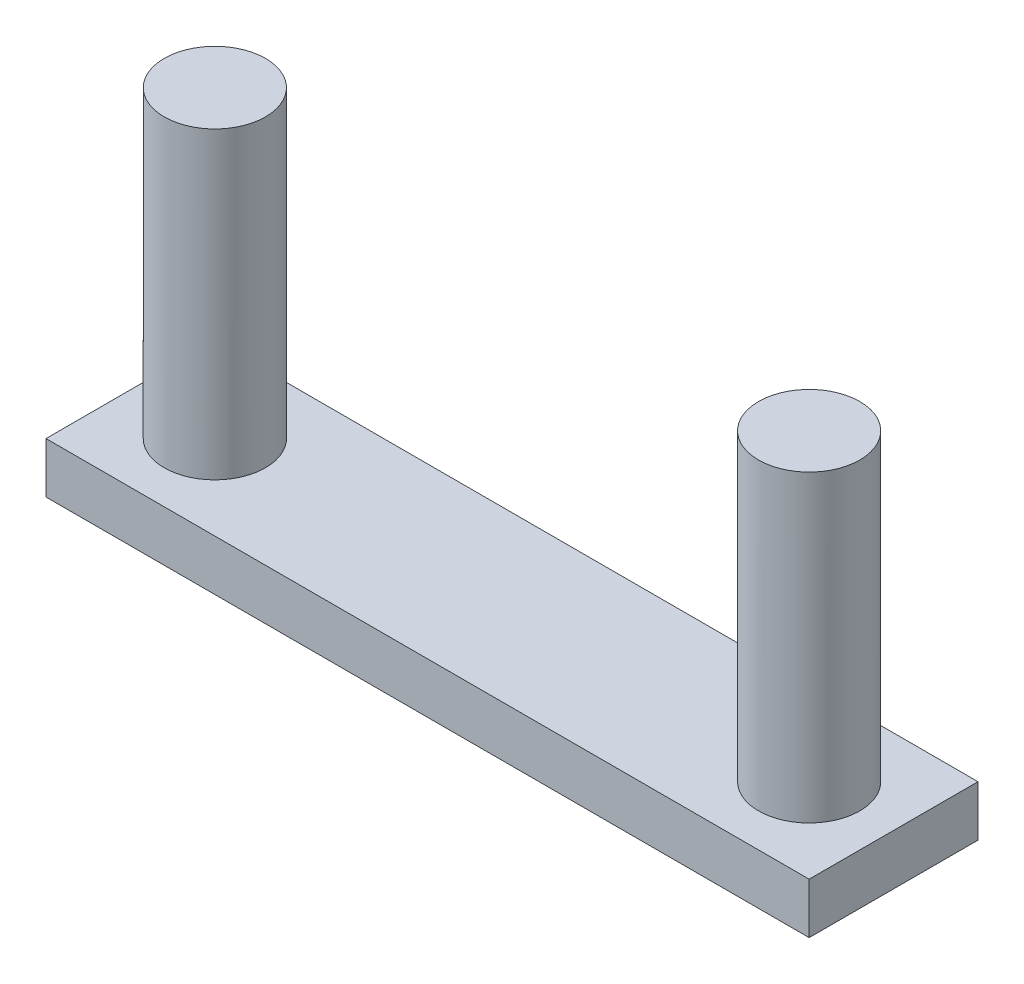
ISO-10303-21;
HEADER;
FILE_DESCRIPTION(('STEP AP214'),'2;1');
FILE_NAME('part.step','',(''),(''),'','','');
FILE_SCHEMA(('AUTOMOTIVE_DESIGN { 1 0 10303 214 1 1 1 1 }'));
ENDSEC;
DATA;
#1=APPLICATION_CONTEXT('core data for automotive mechanical design processes');
#2=APPLICATION_PROTOCOL_DEFINITION('international standard','automotive_design',2000,#1);
#3=PRODUCT_CONTEXT('',#1,'mechanical');
#4=PRODUCT('Part','Part','',(#3));
#5=PRODUCT_RELATED_PRODUCT_CATEGORY('part','',(#4));
#6=PRODUCT_DEFINITION_FORMATION('','',#4);
#7=PRODUCT_DEFINITION_CONTEXT('part definition',#1,'design');
#8=PRODUCT_DEFINITION('design','',#6,#7);
#9=PRODUCT_DEFINITION_SHAPE('','',#8);
#10=(LENGTH_UNIT() NAMED_UNIT(*) SI_UNIT(.MILLI.,.METRE.));
#11=(NAMED_UNIT(*) PLANE_ANGLE_UNIT() SI_UNIT($,.RADIAN.));
#12=(NAMED_UNIT(*) SI_UNIT($,.STERADIAN.) SOLID_ANGLE_UNIT());
#13=UNCERTAINTY_MEASURE_WITH_UNIT(LENGTH_MEASURE(1.E-05),#10,'distance_accuracy_value','');
#14=(GEOMETRIC_REPRESENTATION_CONTEXT(3) GLOBAL_UNCERTAINTY_ASSIGNED_CONTEXT((#13)) GLOBAL_UNIT_ASSIGNED_CONTEXT((#10,
#11,#12)) REPRESENTATION_CONTEXT('',''));
#15=CARTESIAN_POINT('',(0.,0.,0.));
#16=DIRECTION('',(0.,0.,1.));
#17=DIRECTION('',(1.,0.,0.));
#18=AXIS2_PLACEMENT_3D('',#15,#16,#17);
#19=CARTESIAN_POINT('',(-78.4865140429364,1.5,37.3441703001715));
#20=DIRECTION('',(1.,0.,0.));
#21=DIRECTION('',(0.,0.,-1.));
#22=AXIS2_PLACEMENT_3D('',#19,#20,#21);
#23=PLANE('',#22);
#24=DIRECTION('',(0.,0.,1.));
#25=VECTOR('',#24,1.);
#26=CARTESIAN_POINT('',(-78.4865140429364,0.,37.3441703001715));
#27=LINE('',#26,#25);
#28=CARTESIAN_POINT('',(-78.4865140429364,0.,32.3441703001715));
#29=VERTEX_POINT('',#28);
#30=CARTESIAN_POINT('',(-78.4865140429364,0.,37.3441703001715));
#31=VERTEX_POINT('',#30);
#32=EDGE_CURVE('E100',#29,#31,#27,.T.);
#33=ORIENTED_EDGE('',*,*,#32,.T.);
#34=DIRECTION('',(0.,-1.,0.));
#35=VECTOR('',#34,1.);
#36=CARTESIAN_POINT('',(-78.4865140429364,1.5,37.3441703001715));
#37=LINE('',#36,#35);
#38=CARTESIAN_POINT('',(-78.4865140429364,1.5,37.3441703001715));
#39=VERTEX_POINT('',#38);
#40=EDGE_CURVE('E91',#39,#31,#37,.T.);
#41=ORIENTED_EDGE('',*,*,#40,.F.);
#42=DIRECTION('',(0.,0.,1.));
#43=VECTOR('',#42,1.);
#44=CARTESIAN_POINT('',(-78.4865140429364,1.5,37.3441703001715));
#45=LINE('',#44,#43);
#46=CARTESIAN_POINT('',(-78.4865140429364,1.5,32.3441703001715));
#47=VERTEX_POINT('',#46);
#48=EDGE_CURVE('E85',#47,#39,#45,.T.);
#49=ORIENTED_EDGE('',*,*,#48,.F.);
#50=DIRECTION('',(0.,-1.,0.));
#51=VECTOR('',#50,1.);
#52=CARTESIAN_POINT('',(-78.4865140429364,1.5,32.3441703001715));
#53=LINE('',#52,#51);
#54=EDGE_CURVE('E96',#47,#29,#53,.T.);
#55=ORIENTED_EDGE('',*,*,#54,.T.);
#56=EDGE_LOOP('',(#33,#41,#49,#55));
#57=FACE_BOUND('',#56,.T.);
#58=ADVANCED_FACE('F33',(#57),#23,.F.);
#59=CARTESIAN_POINT('',(-78.4865140429364,1.5,37.3441703001715));
#60=DIRECTION('',(0.,0.,-1.));
#61=DIRECTION('',(-1.,0.,0.));
#62=AXIS2_PLACEMENT_3D('',#59,#60,#61);
#63=PLANE('',#62);
#64=DIRECTION('',(1.,0.,0.));
#65=VECTOR('',#64,1.);
#66=CARTESIAN_POINT('',(-78.4865140429364,0.,37.3441703001715));
#67=LINE('',#66,#65);
#68=CARTESIAN_POINT('',(-55.8865140429365,0.,37.3441703001715));
#69=VERTEX_POINT('',#68);
#70=EDGE_CURVE('E90',#31,#69,#67,.T.);
#71=ORIENTED_EDGE('',*,*,#70,.T.);
#72=DIRECTION('',(0.,-1.,0.));
#73=VECTOR('',#72,1.);
#74=CARTESIAN_POINT('',(-55.8865140429365,1.5,37.3441703001715));
#75=LINE('',#74,#73);
#76=CARTESIAN_POINT('',(-55.8865140429365,1.5,37.3441703001715));
#77=VERTEX_POINT('',#76);
#78=EDGE_CURVE('E88',#77,#69,#75,.T.);
#79=ORIENTED_EDGE('',*,*,#78,.F.);
#80=DIRECTION('',(1.,0.,0.));
#81=VECTOR('',#80,1.);
#82=CARTESIAN_POINT('',(-78.4865140429364,1.5,37.3441703001715));
#83=LINE('',#82,#81);
#84=EDGE_CURVE('E80',#39,#77,#83,.T.);
#85=ORIENTED_EDGE('',*,*,#84,.F.);
#86=ORIENTED_EDGE('',*,*,#40,.T.);
#87=EDGE_LOOP('',(#71,#79,#85,#86));
#88=FACE_BOUND('',#87,.T.);
#89=ADVANCED_FACE('F89',(#88),#63,.F.);
#90=CARTESIAN_POINT('',(-55.8865140429365,1.5,37.3441703001715));
#91=DIRECTION('',(-1.,0.,0.));
#92=DIRECTION('',(0.,0.,1.));
#93=AXIS2_PLACEMENT_3D('',#90,#91,#92);
#94=PLANE('',#93);
#95=DIRECTION('',(0.,0.,-1.));
#96=VECTOR('',#95,1.);
#97=CARTESIAN_POINT('',(-55.8865140429365,0.,37.3441703001715));
#98=LINE('',#97,#96);
#99=CARTESIAN_POINT('',(-55.8865140429365,0.,32.3441703001715));
#100=VERTEX_POINT('',#99);
#101=EDGE_CURVE('E66',#69,#100,#98,.T.);
#102=ORIENTED_EDGE('',*,*,#101,.T.);
#103=DIRECTION('',(0.,-1.,0.));
#104=VECTOR('',#103,1.);
#105=CARTESIAN_POINT('',(-55.8865140429365,1.5,32.3441703001715));
#106=LINE('',#105,#104);
#107=CARTESIAN_POINT('',(-55.8865140429365,1.5,32.3441703001715));
#108=VERTEX_POINT('',#107);
#109=EDGE_CURVE('E92',#108,#100,#106,.T.);
#110=ORIENTED_EDGE('',*,*,#109,.F.);
#111=DIRECTION('',(0.,0.,-1.));
#112=VECTOR('',#111,1.);
#113=CARTESIAN_POINT('',(-55.8865140429365,1.5,37.3441703001715));
#114=LINE('',#113,#112);
#115=EDGE_CURVE('E83',#77,#108,#114,.T.);
#116=ORIENTED_EDGE('',*,*,#115,.F.);
#117=ORIENTED_EDGE('',*,*,#78,.T.);
#118=EDGE_LOOP('',(#102,#110,#116,#117));
#119=FACE_BOUND('',#118,.T.);
#120=ADVANCED_FACE('F94',(#119),#94,.F.);
#121=CARTESIAN_POINT('',(-78.4865140429364,1.5,32.3441703001715));
#122=DIRECTION('',(0.,0.,1.));
#123=DIRECTION('',(1.,0.,0.));
#124=AXIS2_PLACEMENT_3D('',#121,#122,#123);
#125=PLANE('',#124);
#126=DIRECTION('',(-1.,0.,0.));
#127=VECTOR('',#126,1.);
#128=CARTESIAN_POINT('',(-78.4865140429364,0.,32.3441703001715));
#129=LINE('',#128,#127);
#130=EDGE_CURVE('E72',#100,#29,#129,.T.);
#131=ORIENTED_EDGE('',*,*,#130,.T.);
#132=ORIENTED_EDGE('',*,*,#54,.F.);
#133=DIRECTION('',(-1.,0.,0.));
#134=VECTOR('',#133,1.);
#135=CARTESIAN_POINT('',(-78.4865140429364,1.5,32.3441703001715));
#136=LINE('',#135,#134);
#137=EDGE_CURVE('E49',#108,#47,#136,.T.);
#138=ORIENTED_EDGE('',*,*,#137,.F.);
#139=ORIENTED_EDGE('',*,*,#109,.T.);
#140=EDGE_LOOP('',(#131,#132,#138,#139));
#141=FACE_BOUND('',#140,.T.);
#142=ADVANCED_FACE('F116',(#141),#125,.F.);
#143=CARTESIAN_POINT('',(0.,1.5,0.));
#144=DIRECTION('',(0.,-1.,0.));
#145=DIRECTION('',(0.,0.,-1.));
#146=AXIS2_PLACEMENT_3D('',#143,#144,#145);
#147=PLANE('',#146);
#148=CARTESIAN_POINT('',(-58.3865140429365,1.5,34.8441703001715));
#149=DIRECTION('',(0.,-1.,0.));
#150=DIRECTION('',(0.,0.,-1.));
#151=AXIS2_PLACEMENT_3D('',#148,#149,#150);
#152=CIRCLE('',#151,1.5);
#153=CARTESIAN_POINT('',(-58.3865140429365,1.5,33.3441703001715));
#154=VERTEX_POINT('',#153);
#155=EDGE_CURVE('E11',#154,#154,#152,.F.);
#156=ORIENTED_EDGE('',*,*,#155,.F.);
#157=EDGE_LOOP('',(#156));
#158=FACE_BOUND('',#157,.T.);
#159=CARTESIAN_POINT('',(-75.9865140429364,1.5,34.8441703001715));
#160=DIRECTION('',(0.,-1.,0.));
#161=DIRECTION('',(0.,0.,-1.));
#162=AXIS2_PLACEMENT_3D('',#159,#160,#161);
#163=CIRCLE('',#162,1.5);
#164=CARTESIAN_POINT('',(-75.9865140429364,1.5,33.3441703001715));
#165=VERTEX_POINT('',#164);
#166=EDGE_CURVE('E41',#165,#165,#163,.F.);
#167=ORIENTED_EDGE('',*,*,#166,.F.);
#168=EDGE_LOOP('',(#167));
#169=FACE_BOUND('',#168,.T.);
#170=ORIENTED_EDGE('',*,*,#48,.T.);
#171=ORIENTED_EDGE('',*,*,#84,.T.);
#172=ORIENTED_EDGE('',*,*,#115,.T.);
#173=ORIENTED_EDGE('',*,*,#137,.T.);
#174=EDGE_LOOP('',(#170,#171,#172,#173));
#175=FACE_BOUND('',#174,.T.);
#176=ADVANCED_FACE('F81',(#158,#169,#175),#147,.F.);
#177=CARTESIAN_POINT('',(0.,0.,0.));
#178=DIRECTION('',(0.,-1.,0.));
#179=DIRECTION('',(0.,0.,-1.));
#180=AXIS2_PLACEMENT_3D('',#177,#178,#179);
#181=PLANE('',#180);
#182=ORIENTED_EDGE('',*,*,#32,.F.);
#183=ORIENTED_EDGE('',*,*,#130,.F.);
#184=ORIENTED_EDGE('',*,*,#101,.F.);
#185=ORIENTED_EDGE('',*,*,#70,.F.);
#186=EDGE_LOOP('',(#182,#183,#184,#185));
#187=FACE_BOUND('',#186,.T.);
#188=ADVANCED_FACE('F115',(#187),#181,.T.);
#189=CARTESIAN_POINT('',(-75.9865140429364,10.5,34.8441703001715));
#190=DIRECTION('',(0.,-1.,0.));
#191=DIRECTION('',(0.,0.,-1.));
#192=AXIS2_PLACEMENT_3D('',#189,#190,#191);
#193=CYLINDRICAL_SURFACE('',#192,1.5);
#194=CARTESIAN_POINT('',(-75.9865140429364,10.5,34.8441703001715));
#195=DIRECTION('',(0.,1.,0.));
#196=DIRECTION('',(0.,0.,1.));
#197=AXIS2_PLACEMENT_3D('',#194,#195,#196);
#198=CIRCLE('',#197,1.5);
#199=CARTESIAN_POINT('',(-75.9865140429364,10.5,36.3441703001715));
#200=VERTEX_POINT('',#199);
#201=EDGE_CURVE('E103',#200,#200,#198,.T.);
#202=ORIENTED_EDGE('',*,*,#201,.F.);
#203=EDGE_LOOP('',(#202));
#204=FACE_BOUND('',#203,.T.);
#205=ORIENTED_EDGE('',*,*,#166,.T.);
#206=EDGE_LOOP('',(#205));
#207=FACE_BOUND('',#206,.T.);
#208=ADVANCED_FACE('F112',(#204,#207),#193,.T.);
#209=CARTESIAN_POINT('',(-75.9865140429364,10.5,34.8441703001715));
#210=DIRECTION('',(0.,1.,0.));
#211=DIRECTION('',(0.,0.,1.));
#212=AXIS2_PLACEMENT_3D('',#209,#210,#211);
#213=PLANE('',#212);
#214=ORIENTED_EDGE('',*,*,#201,.T.);
#215=EDGE_LOOP('',(#214));
#216=FACE_BOUND('',#215,.T.);
#217=ADVANCED_FACE('F146',(#216),#213,.T.);
#218=CARTESIAN_POINT('',(-58.3865140429365,10.5,34.8441703001715));
#219=DIRECTION('',(0.,-1.,0.));
#220=DIRECTION('',(0.,0.,-1.));
#221=AXIS2_PLACEMENT_3D('',#218,#219,#220);
#222=CYLINDRICAL_SURFACE('',#221,1.5);
#223=CARTESIAN_POINT('',(-58.3865140429365,10.5,34.8441703001715));
#224=DIRECTION('',(0.,1.,0.));
#225=DIRECTION('',(0.,0.,1.));
#226=AXIS2_PLACEMENT_3D('',#223,#224,#225);
#227=CIRCLE('',#226,1.5);
#228=CARTESIAN_POINT('',(-58.3865140429365,10.5,36.3441703001715));
#229=VERTEX_POINT('',#228);
#230=EDGE_CURVE('E137',#229,#229,#227,.T.);
#231=ORIENTED_EDGE('',*,*,#230,.F.);
#232=EDGE_LOOP('',(#231));
#233=FACE_BOUND('',#232,.T.);
#234=ORIENTED_EDGE('',*,*,#155,.T.);
#235=EDGE_LOOP('',(#234));
#236=FACE_BOUND('',#235,.T.);
#237=ADVANCED_FACE('F143',(#233,#236),#222,.T.);
#238=CARTESIAN_POINT('',(-58.3865140429365,10.5,34.8441703001715));
#239=DIRECTION('',(0.,1.,0.));
#240=DIRECTION('',(0.,0.,1.));
#241=AXIS2_PLACEMENT_3D('',#238,#239,#240);
#242=PLANE('',#241);
#243=ORIENTED_EDGE('',*,*,#230,.T.);
#244=EDGE_LOOP('',(#243));
#245=FACE_BOUND('',#244,.T.);
#246=ADVANCED_FACE('F141',(#245),#242,.T.);
#247=CLOSED_SHELL('',(#58,#89,#120,#142,#176,#188,#208,#217,#237,#246));
#248=MANIFOLD_SOLID_BREP('B2',#247);
#249=ADVANCED_BREP_SHAPE_REPRESENTATION('',(#18,#248),#14);
#250=SHAPE_DEFINITION_REPRESENTATION(#9,#249);
ENDSEC;
END-ISO-10303-21;
